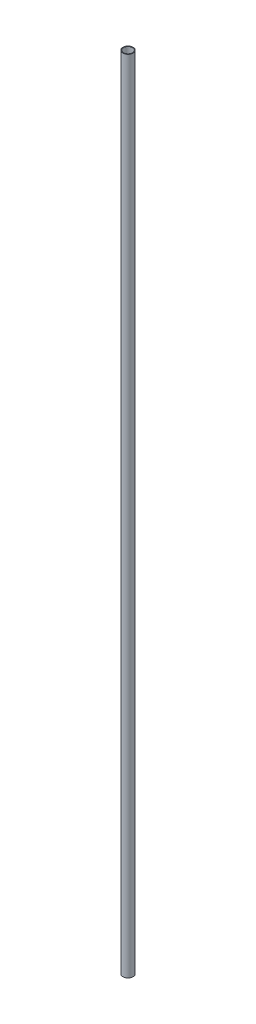
ISO-10303-21;
HEADER;
FILE_DESCRIPTION(('STEP AP214'),'2;1');
FILE_NAME('part.step','',(''),(''),'','','');
FILE_SCHEMA(('AUTOMOTIVE_DESIGN { 1 0 10303 214 1 1 1 1 }'));
ENDSEC;
DATA;
#1=APPLICATION_CONTEXT('core data for automotive mechanical design processes');
#2=APPLICATION_PROTOCOL_DEFINITION('international standard','automotive_design',2000,#1);
#3=PRODUCT_CONTEXT('',#1,'mechanical');
#4=PRODUCT('Part','Part','',(#3));
#5=PRODUCT_RELATED_PRODUCT_CATEGORY('part','',(#4));
#6=PRODUCT_DEFINITION_FORMATION('','',#4);
#7=PRODUCT_DEFINITION_CONTEXT('part definition',#1,'design');
#8=PRODUCT_DEFINITION('design','',#6,#7);
#9=PRODUCT_DEFINITION_SHAPE('','',#8);
#10=(LENGTH_UNIT() NAMED_UNIT(*) SI_UNIT(.MILLI.,.METRE.));
#11=(NAMED_UNIT(*) PLANE_ANGLE_UNIT() SI_UNIT($,.RADIAN.));
#12=(NAMED_UNIT(*) SI_UNIT($,.STERADIAN.) SOLID_ANGLE_UNIT());
#13=UNCERTAINTY_MEASURE_WITH_UNIT(LENGTH_MEASURE(1.E-05),#10,'distance_accuracy_value','');
#14=(GEOMETRIC_REPRESENTATION_CONTEXT(3) GLOBAL_UNCERTAINTY_ASSIGNED_CONTEXT((#13)) GLOBAL_UNIT_ASSIGNED_CONTEXT((#10,
#11,#12)) REPRESENTATION_CONTEXT('',''));
#15=CARTESIAN_POINT('',(0.,0.,0.));
#16=DIRECTION('',(0.,0.,1.));
#17=DIRECTION('',(1.,0.,0.));
#18=AXIS2_PLACEMENT_3D('',#15,#16,#17);
#19=CARTESIAN_POINT('',(0.,3131.82,0.));
#20=DIRECTION('',(0.,1.,0.));
#21=DIRECTION('',(0.,0.,1.));
#22=AXIS2_PLACEMENT_3D('',#19,#20,#21);
#23=PLANE('',#22);
#24=CARTESIAN_POINT('',(0.,3131.82,0.));
#25=DIRECTION('',(0.,1.,0.));
#26=DIRECTION('',(0.,0.,1.));
#27=AXIS2_PLACEMENT_3D('',#24,#25,#26);
#28=CIRCLE('',#27,20.);
#29=CARTESIAN_POINT('',(0.,3131.82,20.));
#30=VERTEX_POINT('',#29);
#31=EDGE_CURVE('E10',#30,#30,#28,.T.);
#32=ORIENTED_EDGE('',*,*,#31,.T.);
#33=EDGE_LOOP('',(#32));
#34=FACE_BOUND('',#33,.T.);
#35=CARTESIAN_POINT('',(0.,3131.82,0.));
#36=DIRECTION('',(0.,1.,0.));
#37=DIRECTION('',(0.,0.,1.));
#38=AXIS2_PLACEMENT_3D('',#35,#36,#37);
#39=CIRCLE('',#38,17.46);
#40=CARTESIAN_POINT('',(0.,3131.82,17.46));
#41=VERTEX_POINT('',#40);
#42=EDGE_CURVE('E44',#41,#41,#39,.T.);
#43=ORIENTED_EDGE('',*,*,#42,.F.);
#44=EDGE_LOOP('',(#43));
#45=FACE_BOUND('',#44,.T.);
#46=ADVANCED_FACE('F33',(#34,#45),#23,.T.);
#47=CARTESIAN_POINT('',(0.,0.,0.));
#48=DIRECTION('',(0.,1.,0.));
#49=DIRECTION('',(0.,0.,1.));
#50=AXIS2_PLACEMENT_3D('',#47,#48,#49);
#51=PLANE('',#50);
#52=CARTESIAN_POINT('',(0.,0.,0.));
#53=DIRECTION('',(0.,1.,0.));
#54=DIRECTION('',(0.,0.,1.));
#55=AXIS2_PLACEMENT_3D('',#52,#53,#54);
#56=CIRCLE('',#55,20.);
#57=CARTESIAN_POINT('',(0.,0.,20.));
#58=VERTEX_POINT('',#57);
#59=EDGE_CURVE('E37',#58,#58,#56,.T.);
#60=ORIENTED_EDGE('',*,*,#59,.F.);
#61=EDGE_LOOP('',(#60));
#62=FACE_BOUND('',#61,.T.);
#63=CARTESIAN_POINT('',(0.,0.,0.));
#64=DIRECTION('',(0.,1.,0.));
#65=DIRECTION('',(0.,0.,1.));
#66=AXIS2_PLACEMENT_3D('',#63,#64,#65);
#67=CIRCLE('',#66,17.46);
#68=CARTESIAN_POINT('',(0.,0.,17.46));
#69=VERTEX_POINT('',#68);
#70=EDGE_CURVE('E46',#69,#69,#67,.T.);
#71=ORIENTED_EDGE('',*,*,#70,.T.);
#72=EDGE_LOOP('',(#71));
#73=FACE_BOUND('',#72,.T.);
#74=ADVANCED_FACE('F56',(#62,#73),#51,.F.);
#75=CARTESIAN_POINT('',(0.,3131.82,0.));
#76=DIRECTION('',(0.,-1.,0.));
#77=DIRECTION('',(0.,0.,-1.));
#78=AXIS2_PLACEMENT_3D('',#75,#76,#77);
#79=CYLINDRICAL_SURFACE('',#78,20.);
#80=ORIENTED_EDGE('',*,*,#31,.F.);
#81=EDGE_LOOP('',(#80));
#82=FACE_BOUND('',#81,.T.);
#83=ORIENTED_EDGE('',*,*,#59,.T.);
#84=EDGE_LOOP('',(#83));
#85=FACE_BOUND('',#84,.T.);
#86=ADVANCED_FACE('F35',(#82,#85),#79,.T.);
#87=CARTESIAN_POINT('',(0.,3131.82,0.));
#88=DIRECTION('',(0.,-1.,0.));
#89=DIRECTION('',(0.,0.,-1.));
#90=AXIS2_PLACEMENT_3D('',#87,#88,#89);
#91=CYLINDRICAL_SURFACE('',#90,17.46);
#92=ORIENTED_EDGE('',*,*,#42,.T.);
#93=EDGE_LOOP('',(#92));
#94=FACE_BOUND('',#93,.T.);
#95=ORIENTED_EDGE('',*,*,#70,.F.);
#96=EDGE_LOOP('',(#95));
#97=FACE_BOUND('',#96,.T.);
#98=ADVANCED_FACE('F52',(#94,#97),#91,.F.);
#99=CLOSED_SHELL('',(#46,#74,#86,#98));
#100=MANIFOLD_SOLID_BREP('B2',#99);
#101=ADVANCED_BREP_SHAPE_REPRESENTATION('',(#18,#100),#14);
#102=SHAPE_DEFINITION_REPRESENTATION(#9,#101);
ENDSEC;
END-ISO-10303-21;
